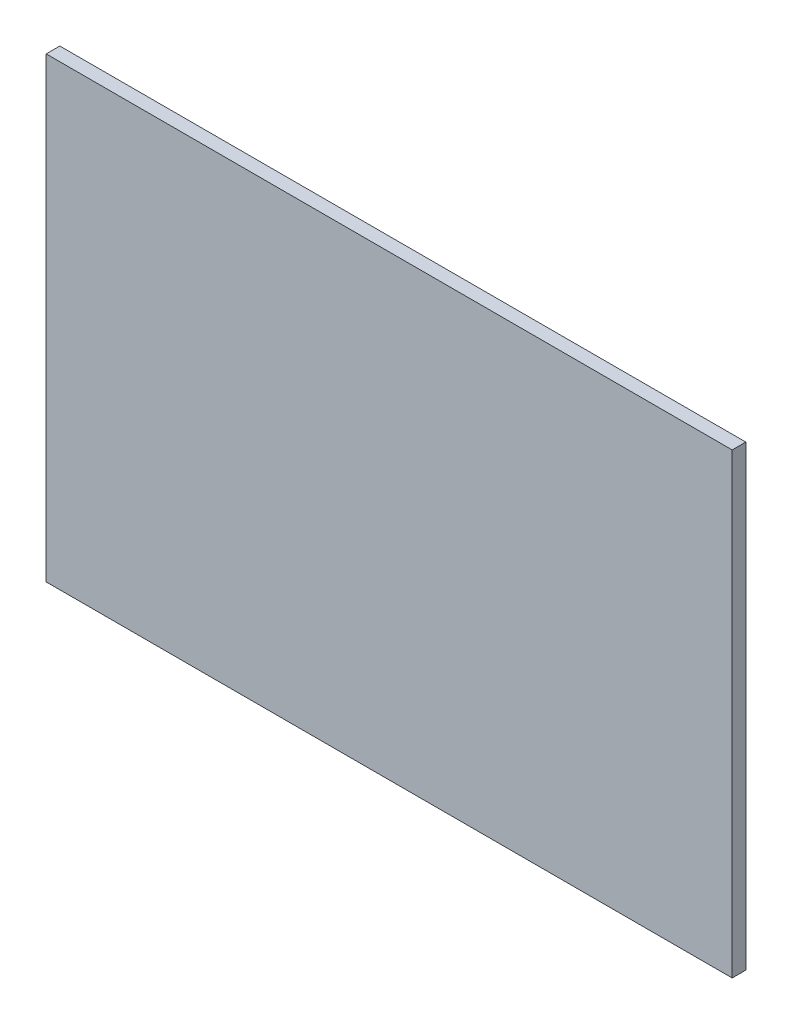
ISO-10303-21;
HEADER;
FILE_DESCRIPTION(('STEP AP214'),'2;1');
FILE_NAME('part.step','',(''),(''),'','','');
FILE_SCHEMA(('AUTOMOTIVE_DESIGN { 1 0 10303 214 1 1 1 1 }'));
ENDSEC;
DATA;
#1=APPLICATION_CONTEXT('core data for automotive mechanical design processes');
#2=APPLICATION_PROTOCOL_DEFINITION('international standard','automotive_design',2000,#1);
#3=PRODUCT_CONTEXT('',#1,'mechanical');
#4=PRODUCT('Part','Part','',(#3));
#5=PRODUCT_RELATED_PRODUCT_CATEGORY('part','',(#4));
#6=PRODUCT_DEFINITION_FORMATION('','',#4);
#7=PRODUCT_DEFINITION_CONTEXT('part definition',#1,'design');
#8=PRODUCT_DEFINITION('design','',#6,#7);
#9=PRODUCT_DEFINITION_SHAPE('','',#8);
#10=(LENGTH_UNIT() NAMED_UNIT(*) SI_UNIT(.MILLI.,.METRE.));
#11=(NAMED_UNIT(*) PLANE_ANGLE_UNIT() SI_UNIT($,.RADIAN.));
#12=(NAMED_UNIT(*) SI_UNIT($,.STERADIAN.) SOLID_ANGLE_UNIT());
#13=UNCERTAINTY_MEASURE_WITH_UNIT(LENGTH_MEASURE(1.E-05),#10,'distance_accuracy_value','');
#14=(GEOMETRIC_REPRESENTATION_CONTEXT(3) GLOBAL_UNCERTAINTY_ASSIGNED_CONTEXT((#13)) GLOBAL_UNIT_ASSIGNED_CONTEXT((#10,
#11,#12)) REPRESENTATION_CONTEXT('',''));
#15=CARTESIAN_POINT('',(0.,0.,0.));
#16=DIRECTION('',(0.,0.,1.));
#17=DIRECTION('',(1.,0.,0.));
#18=AXIS2_PLACEMENT_3D('',#15,#16,#17);
#19=CARTESIAN_POINT('',(-40.26,-26.84,1.6));
#20=DIRECTION('',(1.,0.,0.));
#21=DIRECTION('',(0.,0.,-1.));
#22=AXIS2_PLACEMENT_3D('',#19,#20,#21);
#23=PLANE('',#22);
#24=DIRECTION('',(0.,-1.,0.));
#25=VECTOR('',#24,1.);
#26=CARTESIAN_POINT('',(-40.26,-26.84,0.));
#27=LINE('',#26,#25);
#28=CARTESIAN_POINT('',(-40.26,26.84,0.));
#29=VERTEX_POINT('',#28);
#30=CARTESIAN_POINT('',(-40.26,-26.84,0.));
#31=VERTEX_POINT('',#30);
#32=EDGE_CURVE('E105',#29,#31,#27,.T.);
#33=ORIENTED_EDGE('',*,*,#32,.T.);
#34=DIRECTION('',(0.,0.,-1.));
#35=VECTOR('',#34,1.);
#36=CARTESIAN_POINT('',(-40.26,-26.84,1.6));
#37=LINE('',#36,#35);
#38=CARTESIAN_POINT('',(-40.26,-26.84,1.6));
#39=VERTEX_POINT('',#38);
#40=EDGE_CURVE('E11',#39,#31,#37,.T.);
#41=ORIENTED_EDGE('',*,*,#40,.F.);
#42=DIRECTION('',(0.,-1.,0.));
#43=VECTOR('',#42,1.);
#44=CARTESIAN_POINT('',(-40.26,-26.84,1.6));
#45=LINE('',#44,#43);
#46=CARTESIAN_POINT('',(-40.26,26.84,1.6));
#47=VERTEX_POINT('',#46);
#48=EDGE_CURVE('E89',#47,#39,#45,.T.);
#49=ORIENTED_EDGE('',*,*,#48,.F.);
#50=DIRECTION('',(0.,0.,-1.));
#51=VECTOR('',#50,1.);
#52=CARTESIAN_POINT('',(-40.26,26.84,1.6));
#53=LINE('',#52,#51);
#54=EDGE_CURVE('E97',#47,#29,#53,.T.);
#55=ORIENTED_EDGE('',*,*,#54,.T.);
#56=EDGE_LOOP('',(#33,#41,#49,#55));
#57=FACE_BOUND('',#56,.T.);
#58=ADVANCED_FACE('F39',(#57),#23,.F.);
#59=CARTESIAN_POINT('',(40.26,-26.84,1.6));
#60=DIRECTION('',(0.,1.,0.));
#61=DIRECTION('',(-1.,0.,0.));
#62=AXIS2_PLACEMENT_3D('',#59,#60,#61);
#63=PLANE('',#62);
#64=DIRECTION('',(1.,0.,0.));
#65=VECTOR('',#64,1.);
#66=CARTESIAN_POINT('',(40.26,-26.84,0.));
#67=LINE('',#66,#65);
#68=CARTESIAN_POINT('',(40.26,-26.84,0.));
#69=VERTEX_POINT('',#68);
#70=EDGE_CURVE('E92',#31,#69,#67,.T.);
#71=ORIENTED_EDGE('',*,*,#70,.T.);
#72=DIRECTION('',(0.,0.,-1.));
#73=VECTOR('',#72,1.);
#74=CARTESIAN_POINT('',(40.26,-26.84,1.6));
#75=LINE('',#74,#73);
#76=CARTESIAN_POINT('',(40.26,-26.84,1.6));
#77=VERTEX_POINT('',#76);
#78=EDGE_CURVE('E50',#77,#69,#75,.T.);
#79=ORIENTED_EDGE('',*,*,#78,.F.);
#80=DIRECTION('',(1.,0.,0.));
#81=VECTOR('',#80,1.);
#82=CARTESIAN_POINT('',(40.26,-26.84,1.6));
#83=LINE('',#82,#81);
#84=EDGE_CURVE('E82',#39,#77,#83,.T.);
#85=ORIENTED_EDGE('',*,*,#84,.F.);
#86=ORIENTED_EDGE('',*,*,#40,.T.);
#87=EDGE_LOOP('',(#71,#79,#85,#86));
#88=FACE_BOUND('',#87,.T.);
#89=ADVANCED_FACE('F93',(#88),#63,.F.);
#90=CARTESIAN_POINT('',(40.26,-26.84,1.6));
#91=DIRECTION('',(-1.,0.,0.));
#92=DIRECTION('',(0.,0.,1.));
#93=AXIS2_PLACEMENT_3D('',#90,#91,#92);
#94=PLANE('',#93);
#95=DIRECTION('',(0.,1.,0.));
#96=VECTOR('',#95,1.);
#97=CARTESIAN_POINT('',(40.26,-26.84,0.));
#98=LINE('',#97,#96);
#99=CARTESIAN_POINT('',(40.26,26.84,0.));
#100=VERTEX_POINT('',#99);
#101=EDGE_CURVE('E72',#69,#100,#98,.T.);
#102=ORIENTED_EDGE('',*,*,#101,.T.);
#103=DIRECTION('',(0.,0.,-1.));
#104=VECTOR('',#103,1.);
#105=CARTESIAN_POINT('',(40.26,26.84,1.6));
#106=LINE('',#105,#104);
#107=CARTESIAN_POINT('',(40.26,26.84,1.6));
#108=VERTEX_POINT('',#107);
#109=EDGE_CURVE('E94',#108,#100,#106,.T.);
#110=ORIENTED_EDGE('',*,*,#109,.F.);
#111=DIRECTION('',(0.,1.,0.));
#112=VECTOR('',#111,1.);
#113=CARTESIAN_POINT('',(40.26,-26.84,1.6));
#114=LINE('',#113,#112);
#115=EDGE_CURVE('E88',#77,#108,#114,.T.);
#116=ORIENTED_EDGE('',*,*,#115,.F.);
#117=ORIENTED_EDGE('',*,*,#78,.T.);
#118=EDGE_LOOP('',(#102,#110,#116,#117));
#119=FACE_BOUND('',#118,.T.);
#120=ADVANCED_FACE('F96',(#119),#94,.F.);
#121=CARTESIAN_POINT('',(40.26,26.84,1.6));
#122=DIRECTION('',(0.,-1.,0.));
#123=DIRECTION('',(1.,0.,0.));
#124=AXIS2_PLACEMENT_3D('',#121,#122,#123);
#125=PLANE('',#124);
#126=DIRECTION('',(-1.,0.,0.));
#127=VECTOR('',#126,1.);
#128=CARTESIAN_POINT('',(40.26,26.84,0.));
#129=LINE('',#128,#127);
#130=EDGE_CURVE('E76',#100,#29,#129,.T.);
#131=ORIENTED_EDGE('',*,*,#130,.T.);
#132=ORIENTED_EDGE('',*,*,#54,.F.);
#133=DIRECTION('',(-1.,0.,0.));
#134=VECTOR('',#133,1.);
#135=CARTESIAN_POINT('',(40.26,26.84,1.6));
#136=LINE('',#135,#134);
#137=EDGE_CURVE('E54',#108,#47,#136,.T.);
#138=ORIENTED_EDGE('',*,*,#137,.F.);
#139=ORIENTED_EDGE('',*,*,#109,.T.);
#140=EDGE_LOOP('',(#131,#132,#138,#139));
#141=FACE_BOUND('',#140,.T.);
#142=ADVANCED_FACE('F108',(#141),#125,.F.);
#143=CARTESIAN_POINT('',(0.,0.,1.6));
#144=DIRECTION('',(0.,0.,1.));
#145=DIRECTION('',(1.,0.,0.));
#146=AXIS2_PLACEMENT_3D('',#143,#144,#145);
#147=PLANE('',#146);
#148=ORIENTED_EDGE('',*,*,#48,.T.);
#149=ORIENTED_EDGE('',*,*,#84,.T.);
#150=ORIENTED_EDGE('',*,*,#115,.T.);
#151=ORIENTED_EDGE('',*,*,#137,.T.);
#152=EDGE_LOOP('',(#148,#149,#150,#151));
#153=FACE_BOUND('',#152,.T.);
#154=ADVANCED_FACE('F86',(#153),#147,.T.);
#155=CARTESIAN_POINT('',(0.,0.,0.));
#156=DIRECTION('',(0.,0.,1.));
#157=DIRECTION('',(1.,0.,0.));
#158=AXIS2_PLACEMENT_3D('',#155,#156,#157);
#159=PLANE('',#158);
#160=ORIENTED_EDGE('',*,*,#32,.F.);
#161=ORIENTED_EDGE('',*,*,#130,.F.);
#162=ORIENTED_EDGE('',*,*,#101,.F.);
#163=ORIENTED_EDGE('',*,*,#70,.F.);
#164=EDGE_LOOP('',(#160,#161,#162,#163));
#165=FACE_BOUND('',#164,.T.);
#166=ADVANCED_FACE('F115',(#165),#159,.F.);
#167=CLOSED_SHELL('',(#58,#89,#120,#142,#154,#166));
#168=MANIFOLD_SOLID_BREP('B2',#167);
#169=ADVANCED_BREP_SHAPE_REPRESENTATION('',(#18,#168),#14);
#170=SHAPE_DEFINITION_REPRESENTATION(#9,#169);
ENDSEC;
END-ISO-10303-21;
